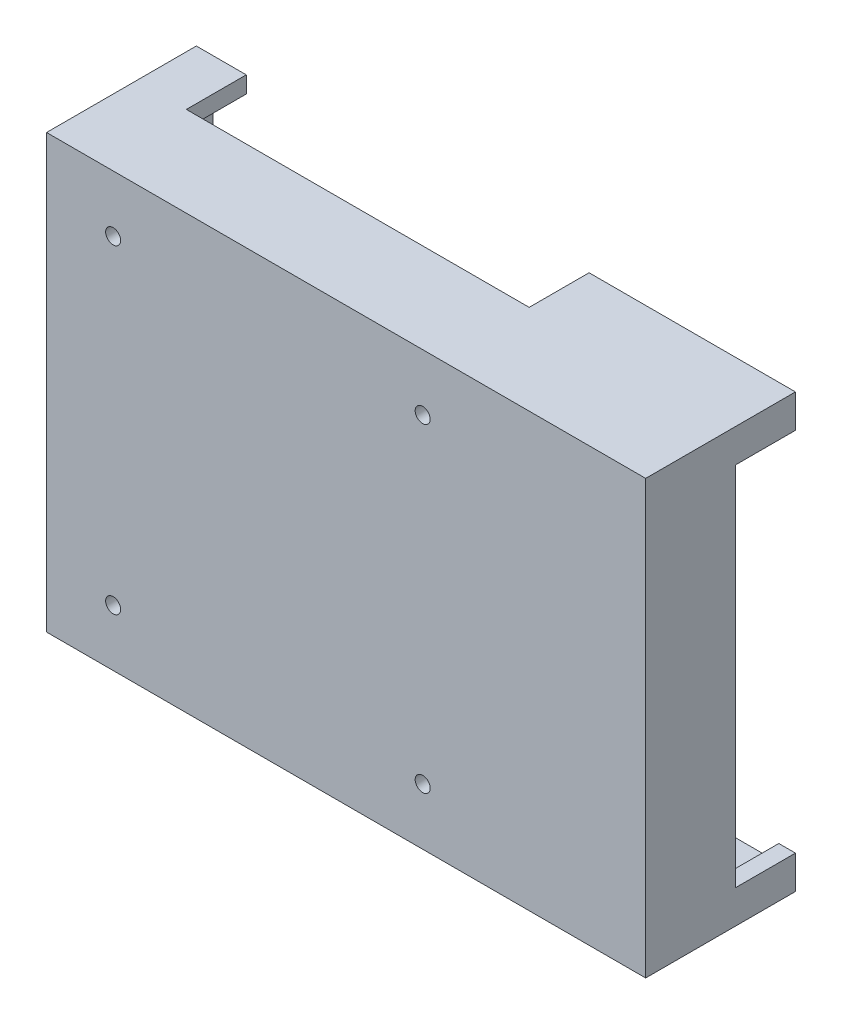
ISO-10303-21;
HEADER;
FILE_DESCRIPTION(('STEP AP214'),'2;1');
FILE_NAME('part.step','',(''),(''),'','','');
FILE_SCHEMA(('AUTOMOTIVE_DESIGN { 1 0 10303 214 1 1 1 1 }'));
ENDSEC;
DATA;
#1=APPLICATION_CONTEXT('core data for automotive mechanical design processes');
#2=APPLICATION_PROTOCOL_DEFINITION('international standard','automotive_design',2000,#1);
#3=PRODUCT_CONTEXT('',#1,'mechanical');
#4=PRODUCT('Part','Part','',(#3));
#5=PRODUCT_RELATED_PRODUCT_CATEGORY('part','',(#4));
#6=PRODUCT_DEFINITION_FORMATION('','',#4);
#7=PRODUCT_DEFINITION_CONTEXT('part definition',#1,'design');
#8=PRODUCT_DEFINITION('design','',#6,#7);
#9=PRODUCT_DEFINITION_SHAPE('','',#8);
#10=(LENGTH_UNIT() NAMED_UNIT(*) SI_UNIT(.MILLI.,.METRE.));
#11=(NAMED_UNIT(*) PLANE_ANGLE_UNIT() SI_UNIT($,.RADIAN.));
#12=(NAMED_UNIT(*) SI_UNIT($,.STERADIAN.) SOLID_ANGLE_UNIT());
#13=UNCERTAINTY_MEASURE_WITH_UNIT(LENGTH_MEASURE(1.E-05),#10,'distance_accuracy_value','');
#14=(GEOMETRIC_REPRESENTATION_CONTEXT(3) GLOBAL_UNCERTAINTY_ASSIGNED_CONTEXT((#13)) GLOBAL_UNIT_ASSIGNED_CONTEXT((#10,
#11,#12)) REPRESENTATION_CONTEXT('',''));
#15=CARTESIAN_POINT('',(0.,0.,0.));
#16=DIRECTION('',(0.,0.,1.));
#17=DIRECTION('',(1.,0.,0.));
#18=AXIS2_PLACEMENT_3D('',#15,#16,#17);
#19=CARTESIAN_POINT('',(0.,0.,0.));
#20=DIRECTION('',(0.,0.,1.));
#21=DIRECTION('',(1.,0.,0.));
#22=AXIS2_PLACEMENT_3D('',#19,#20,#21);
#23=PLANE('',#22);
#24=DIRECTION('',(-1.,0.,0.));
#25=VECTOR('',#24,1.);
#26=CARTESIAN_POINT('',(90.,65.,0.));
#27=LINE('',#26,#25);
#28=CARTESIAN_POINT('',(-75.,65.,0.));
#29=VERTEX_POINT('',#28);
#30=CARTESIAN_POINT('',(-90.,65.,0.));
#31=VERTEX_POINT('',#30);
#32=EDGE_CURVE('E211',#29,#31,#27,.T.);
#33=ORIENTED_EDGE('',*,*,#32,.F.);
#34=DIRECTION('',(0.,-1.,0.));
#35=VECTOR('',#34,1.);
#36=CARTESIAN_POINT('',(-75.,169.560986988456,0.));
#37=LINE('',#36,#35);
#38=CARTESIAN_POINT('',(-75.,60.,0.));
#39=VERTEX_POINT('',#38);
#40=EDGE_CURVE('E194',#29,#39,#37,.T.);
#41=ORIENTED_EDGE('',*,*,#40,.T.);
#42=DIRECTION('',(-1.,0.,0.));
#43=VECTOR('',#42,1.);
#44=CARTESIAN_POINT('',(-85.,60.,0.));
#45=LINE('',#44,#43);
#46=CARTESIAN_POINT('',(-85.,60.,0.));
#47=VERTEX_POINT('',#46);
#48=EDGE_CURVE('E323',#39,#47,#45,.T.);
#49=ORIENTED_EDGE('',*,*,#48,.T.);
#50=DIRECTION('',(0.,-1.,0.));
#51=VECTOR('',#50,1.);
#52=CARTESIAN_POINT('',(-85.,-60.,0.));
#53=LINE('',#52,#51);
#54=CARTESIAN_POINT('',(-85.,-60.,0.));
#55=VERTEX_POINT('',#54);
#56=EDGE_CURVE('E327',#47,#55,#53,.T.);
#57=ORIENTED_EDGE('',*,*,#56,.T.);
#58=DIRECTION('',(1.,0.,0.));
#59=VECTOR('',#58,1.);
#60=CARTESIAN_POINT('',(-85.,-60.,0.));
#61=LINE('',#60,#59);
#62=CARTESIAN_POINT('',(-75.,-60.,0.));
#63=VERTEX_POINT('',#62);
#64=EDGE_CURVE('E193',#55,#63,#61,.T.);
#65=ORIENTED_EDGE('',*,*,#64,.T.);
#66=CARTESIAN_POINT('',(-75.,-65.,0.));
#67=VERTEX_POINT('',#66);
#68=EDGE_CURVE('E175',#63,#67,#37,.T.);
#69=ORIENTED_EDGE('',*,*,#68,.T.);
#70=DIRECTION('',(1.,0.,0.));
#71=VECTOR('',#70,1.);
#72=CARTESIAN_POINT('',(90.,-65.,0.));
#73=LINE('',#72,#71);
#74=CARTESIAN_POINT('',(-90.,-65.,0.));
#75=VERTEX_POINT('',#74);
#76=EDGE_CURVE('E189',#75,#67,#73,.T.);
#77=ORIENTED_EDGE('',*,*,#76,.F.);
#78=DIRECTION('',(0.,-1.,0.));
#79=VECTOR('',#78,1.);
#80=CARTESIAN_POINT('',(-90.,-65.,0.));
#81=LINE('',#80,#79);
#82=EDGE_CURVE('E206',#31,#75,#81,.T.);
#83=ORIENTED_EDGE('',*,*,#82,.F.);
#84=EDGE_LOOP('',(#33,#41,#49,#57,#65,#69,#77,#83));
#85=FACE_BOUND('',#84,.T.);
#86=ADVANCED_FACE('F37',(#85),#23,.F.);
#87=CARTESIAN_POINT('',(28.,-65.,0.));
#88=VERTEX_POINT('',#87);
#89=CARTESIAN_POINT('',(90.,-65.,0.));
#90=VERTEX_POINT('',#89);
#91=EDGE_CURVE('E202',#88,#90,#73,.T.);
#92=ORIENTED_EDGE('',*,*,#91,.F.);
#93=DIRECTION('',(0.,-1.,0.));
#94=VECTOR('',#93,1.);
#95=CARTESIAN_POINT('',(28.,169.560986988456,0.));
#96=LINE('',#95,#94);
#97=CARTESIAN_POINT('',(28.,-60.,0.));
#98=VERTEX_POINT('',#97);
#99=EDGE_CURVE('E239',#98,#88,#96,.T.);
#100=ORIENTED_EDGE('',*,*,#99,.F.);
#101=CARTESIAN_POINT('',(85.,-60.,0.));
#102=VERTEX_POINT('',#101);
#103=EDGE_CURVE('E236',#98,#102,#61,.T.);
#104=ORIENTED_EDGE('',*,*,#103,.T.);
#105=DIRECTION('',(0.,1.,0.));
#106=VECTOR('',#105,1.);
#107=CARTESIAN_POINT('',(85.,-60.,0.));
#108=LINE('',#107,#106);
#109=CARTESIAN_POINT('',(85.,-55.,0.));
#110=VERTEX_POINT('',#109);
#111=EDGE_CURVE('E321',#102,#110,#108,.T.);
#112=ORIENTED_EDGE('',*,*,#111,.T.);
#113=DIRECTION('',(1.,0.,0.));
#114=VECTOR('',#113,1.);
#115=CARTESIAN_POINT('',(-90.001,-55.,0.));
#116=LINE('',#115,#114);
#117=CARTESIAN_POINT('',(90.,-55.,0.));
#118=VERTEX_POINT('',#117);
#119=EDGE_CURVE('E278',#110,#118,#116,.T.);
#120=ORIENTED_EDGE('',*,*,#119,.T.);
#121=DIRECTION('',(0.,1.,0.));
#122=VECTOR('',#121,1.);
#123=CARTESIAN_POINT('',(90.,-65.,0.));
#124=LINE('',#123,#122);
#125=EDGE_CURVE('E204',#90,#118,#124,.T.);
#126=ORIENTED_EDGE('',*,*,#125,.F.);
#127=EDGE_LOOP('',(#92,#100,#104,#112,#120,#126));
#128=FACE_BOUND('',#127,.T.);
#129=ADVANCED_FACE('F243',(#128),#23,.F.);
#130=CARTESIAN_POINT('',(85.,60.,0.));
#131=VERTEX_POINT('',#130);
#132=CARTESIAN_POINT('',(28.,60.,0.));
#133=VERTEX_POINT('',#132);
#134=EDGE_CURVE('E324',#131,#133,#45,.T.);
#135=ORIENTED_EDGE('',*,*,#134,.T.);
#136=CARTESIAN_POINT('',(28.,65.,0.));
#137=VERTEX_POINT('',#136);
#138=EDGE_CURVE('E52',#137,#133,#96,.T.);
#139=ORIENTED_EDGE('',*,*,#138,.F.);
#140=CARTESIAN_POINT('',(90.,65.,0.));
#141=VERTEX_POINT('',#140);
#142=EDGE_CURVE('E212',#141,#137,#27,.T.);
#143=ORIENTED_EDGE('',*,*,#142,.F.);
#144=CARTESIAN_POINT('',(90.,55.,0.));
#145=VERTEX_POINT('',#144);
#146=EDGE_CURVE('E201',#145,#141,#124,.T.);
#147=ORIENTED_EDGE('',*,*,#146,.F.);
#148=DIRECTION('',(1.,0.,0.));
#149=VECTOR('',#148,1.);
#150=CARTESIAN_POINT('',(-90.001,55.,0.));
#151=LINE('',#150,#149);
#152=CARTESIAN_POINT('',(85.,55.,0.));
#153=VERTEX_POINT('',#152);
#154=EDGE_CURVE('E260',#153,#145,#151,.T.);
#155=ORIENTED_EDGE('',*,*,#154,.F.);
#156=EDGE_CURVE('E310',#153,#131,#108,.T.);
#157=ORIENTED_EDGE('',*,*,#156,.T.);
#158=EDGE_LOOP('',(#135,#139,#143,#147,#155,#157));
#159=FACE_BOUND('',#158,.T.);
#160=ADVANCED_FACE('F379',(#159),#23,.F.);
#161=CARTESIAN_POINT('',(-90.,-65.,45.));
#162=DIRECTION('',(1.,0.,0.));
#163=DIRECTION('',(0.,0.,-1.));
#164=AXIS2_PLACEMENT_3D('',#161,#162,#163);
#165=PLANE('',#164);
#166=ORIENTED_EDGE('',*,*,#82,.T.);
#167=DIRECTION('',(0.,0.,-1.));
#168=VECTOR('',#167,1.);
#169=CARTESIAN_POINT('',(-90.,-65.,45.));
#170=LINE('',#169,#168);
#171=CARTESIAN_POINT('',(-90.,-65.,45.));
#172=VERTEX_POINT('',#171);
#173=EDGE_CURVE('E199',#172,#75,#170,.T.);
#174=ORIENTED_EDGE('',*,*,#173,.F.);
#175=DIRECTION('',(0.,-1.,0.));
#176=VECTOR('',#175,1.);
#177=CARTESIAN_POINT('',(-90.,-65.,45.));
#178=LINE('',#177,#176);
#179=CARTESIAN_POINT('',(-90.,65.,45.));
#180=VERTEX_POINT('',#179);
#181=EDGE_CURVE('E215',#180,#172,#178,.T.);
#182=ORIENTED_EDGE('',*,*,#181,.F.);
#183=DIRECTION('',(0.,0.,-1.));
#184=VECTOR('',#183,1.);
#185=CARTESIAN_POINT('',(-90.,65.,45.));
#186=LINE('',#185,#184);
#187=EDGE_CURVE('E216',#180,#31,#186,.T.);
#188=ORIENTED_EDGE('',*,*,#187,.T.);
#189=EDGE_LOOP('',(#166,#174,#182,#188));
#190=FACE_BOUND('',#189,.T.);
#191=ADVANCED_FACE('F39',(#190),#165,.F.);
#192=CARTESIAN_POINT('',(90.,-65.,45.));
#193=DIRECTION('',(0.,1.,0.));
#194=DIRECTION('',(-1.,0.,0.));
#195=AXIS2_PLACEMENT_3D('',#192,#193,#194);
#196=PLANE('',#195);
#197=ORIENTED_EDGE('',*,*,#76,.T.);
#198=DIRECTION('',(0.,0.,-1.));
#199=VECTOR('',#198,1.);
#200=CARTESIAN_POINT('',(-75.,-65.,0.));
#201=LINE('',#200,#199);
#202=CARTESIAN_POINT('',(-75.,-65.,18.));
#203=VERTEX_POINT('',#202);
#204=EDGE_CURVE('E172',#203,#67,#201,.T.);
#205=ORIENTED_EDGE('',*,*,#204,.F.);
#206=DIRECTION('',(-1.,0.,0.));
#207=VECTOR('',#206,1.);
#208=CARTESIAN_POINT('',(-75.,-65.,18.));
#209=LINE('',#208,#207);
#210=CARTESIAN_POINT('',(28.,-65.,18.));
#211=VERTEX_POINT('',#210);
#212=EDGE_CURVE('E195',#211,#203,#209,.T.);
#213=ORIENTED_EDGE('',*,*,#212,.F.);
#214=DIRECTION('',(0.,0.,1.));
#215=VECTOR('',#214,1.);
#216=CARTESIAN_POINT('',(28.,-65.,0.));
#217=LINE('',#216,#215);
#218=EDGE_CURVE('E183',#88,#211,#217,.T.);
#219=ORIENTED_EDGE('',*,*,#218,.F.);
#220=ORIENTED_EDGE('',*,*,#91,.T.);
#221=DIRECTION('',(0.,0.,-1.));
#222=VECTOR('',#221,1.);
#223=CARTESIAN_POINT('',(90.,-65.,45.));
#224=LINE('',#223,#222);
#225=CARTESIAN_POINT('',(90.,-65.,45.));
#226=VERTEX_POINT('',#225);
#227=EDGE_CURVE('E223',#226,#90,#224,.T.);
#228=ORIENTED_EDGE('',*,*,#227,.F.);
#229=DIRECTION('',(1.,0.,0.));
#230=VECTOR('',#229,1.);
#231=CARTESIAN_POINT('',(90.,-65.,45.));
#232=LINE('',#231,#230);
#233=EDGE_CURVE('E341',#172,#226,#232,.T.);
#234=ORIENTED_EDGE('',*,*,#233,.F.);
#235=ORIENTED_EDGE('',*,*,#173,.T.);
#236=EDGE_LOOP('',(#197,#205,#213,#219,#220,#228,#234,#235));
#237=FACE_BOUND('',#236,.T.);
#238=ADVANCED_FACE('F197',(#237),#196,.F.);
#239=CARTESIAN_POINT('',(90.,-65.,45.));
#240=DIRECTION('',(-1.,0.,0.));
#241=DIRECTION('',(0.,-1.,0.));
#242=AXIS2_PLACEMENT_3D('',#239,#240,#241);
#243=PLANE('',#242);
#244=ORIENTED_EDGE('',*,*,#125,.T.);
#245=DIRECTION('',(0.,0.,-1.));
#246=VECTOR('',#245,1.);
#247=CARTESIAN_POINT('',(90.,-55.,0.));
#248=LINE('',#247,#246);
#249=CARTESIAN_POINT('',(90.,-55.,18.));
#250=VERTEX_POINT('',#249);
#251=EDGE_CURVE('E266',#250,#118,#248,.T.);
#252=ORIENTED_EDGE('',*,*,#251,.F.);
#253=DIRECTION('',(0.,-1.,0.));
#254=VECTOR('',#253,1.);
#255=CARTESIAN_POINT('',(90.,55.,18.));
#256=LINE('',#255,#254);
#257=CARTESIAN_POINT('',(90.,55.,18.));
#258=VERTEX_POINT('',#257);
#259=EDGE_CURVE('E269',#258,#250,#256,.T.);
#260=ORIENTED_EDGE('',*,*,#259,.F.);
#261=DIRECTION('',(0.,0.,1.));
#262=VECTOR('',#261,1.);
#263=CARTESIAN_POINT('',(90.,55.,0.));
#264=LINE('',#263,#262);
#265=EDGE_CURVE('E272',#145,#258,#264,.T.);
#266=ORIENTED_EDGE('',*,*,#265,.F.);
#267=ORIENTED_EDGE('',*,*,#146,.T.);
#268=DIRECTION('',(0.,0.,-1.));
#269=VECTOR('',#268,1.);
#270=CARTESIAN_POINT('',(90.,65.,45.));
#271=LINE('',#270,#269);
#272=CARTESIAN_POINT('',(90.,65.,45.));
#273=VERTEX_POINT('',#272);
#274=EDGE_CURVE('E219',#273,#141,#271,.T.);
#275=ORIENTED_EDGE('',*,*,#274,.F.);
#276=DIRECTION('',(0.,1.,0.));
#277=VECTOR('',#276,1.);
#278=CARTESIAN_POINT('',(90.,-65.,45.));
#279=LINE('',#278,#277);
#280=EDGE_CURVE('E343',#226,#273,#279,.T.);
#281=ORIENTED_EDGE('',*,*,#280,.F.);
#282=ORIENTED_EDGE('',*,*,#227,.T.);
#283=EDGE_LOOP('',(#244,#252,#260,#266,#267,#275,#281,#282));
#284=FACE_BOUND('',#283,.T.);
#285=ADVANCED_FACE('F395',(#284),#243,.F.);
#286=CARTESIAN_POINT('',(90.,65.,45.));
#287=DIRECTION('',(0.,-1.,0.));
#288=DIRECTION('',(1.,0.,0.));
#289=AXIS2_PLACEMENT_3D('',#286,#287,#288);
#290=PLANE('',#289);
#291=DIRECTION('',(1.,0.,0.));
#292=VECTOR('',#291,1.);
#293=CARTESIAN_POINT('',(-75.,65.,18.));
#294=LINE('',#293,#292);
#295=CARTESIAN_POINT('',(-75.,65.,18.));
#296=VERTEX_POINT('',#295);
#297=CARTESIAN_POINT('',(28.,65.,18.));
#298=VERTEX_POINT('',#297);
#299=EDGE_CURVE('E404',#296,#298,#294,.T.);
#300=ORIENTED_EDGE('',*,*,#299,.F.);
#301=DIRECTION('',(0.,0.,1.));
#302=VECTOR('',#301,1.);
#303=CARTESIAN_POINT('',(-75.,65.,0.));
#304=LINE('',#303,#302);
#305=EDGE_CURVE('E256',#29,#296,#304,.T.);
#306=ORIENTED_EDGE('',*,*,#305,.F.);
#307=ORIENTED_EDGE('',*,*,#32,.T.);
#308=ORIENTED_EDGE('',*,*,#187,.F.);
#309=DIRECTION('',(-1.,0.,0.));
#310=VECTOR('',#309,1.);
#311=CARTESIAN_POINT('',(90.,65.,45.));
#312=LINE('',#311,#310);
#313=EDGE_CURVE('E220',#273,#180,#312,.T.);
#314=ORIENTED_EDGE('',*,*,#313,.F.);
#315=ORIENTED_EDGE('',*,*,#274,.T.);
#316=ORIENTED_EDGE('',*,*,#142,.T.);
#317=DIRECTION('',(0.,0.,-1.));
#318=VECTOR('',#317,1.);
#319=CARTESIAN_POINT('',(28.,65.,0.));
#320=LINE('',#319,#318);
#321=EDGE_CURVE('E402',#298,#137,#320,.T.);
#322=ORIENTED_EDGE('',*,*,#321,.F.);
#323=EDGE_LOOP('',(#300,#306,#307,#308,#314,#315,#316,#322));
#324=FACE_BOUND('',#323,.T.);
#325=ADVANCED_FACE('F353',(#324),#290,.F.);
#326=CARTESIAN_POINT('',(0.,0.,45.));
#327=DIRECTION('',(0.,0.,1.));
#328=DIRECTION('',(1.,0.,0.));
#329=AXIS2_PLACEMENT_3D('',#326,#327,#328);
#330=PLANE('',#329);
#331=CARTESIAN_POINT('',(23.,-48.,45.));
#332=DIRECTION('',(0.,0.,-1.));
#333=DIRECTION('',(-1.,0.,0.));
#334=AXIS2_PLACEMENT_3D('',#331,#332,#333);
#335=CIRCLE('',#334,2.25);
#336=CARTESIAN_POINT('',(20.75,-48.,45.));
#337=VERTEX_POINT('',#336);
#338=EDGE_CURVE('E289',#337,#337,#335,.T.);
#339=ORIENTED_EDGE('',*,*,#338,.T.);
#340=EDGE_LOOP('',(#339));
#341=FACE_BOUND('',#340,.T.);
#342=CARTESIAN_POINT('',(-70.,-48.,45.));
#343=DIRECTION('',(0.,0.,-1.));
#344=DIRECTION('',(-1.,0.,0.));
#345=AXIS2_PLACEMENT_3D('',#342,#343,#344);
#346=CIRCLE('',#345,2.25);
#347=CARTESIAN_POINT('',(-72.25,-48.,45.));
#348=VERTEX_POINT('',#347);
#349=EDGE_CURVE('E295',#348,#348,#346,.T.);
#350=ORIENTED_EDGE('',*,*,#349,.T.);
#351=EDGE_LOOP('',(#350));
#352=FACE_BOUND('',#351,.T.);
#353=CARTESIAN_POINT('',(-70.,48.,45.));
#354=DIRECTION('',(0.,0.,-1.));
#355=DIRECTION('',(-1.,0.,0.));
#356=AXIS2_PLACEMENT_3D('',#353,#354,#355);
#357=CIRCLE('',#356,2.25);
#358=CARTESIAN_POINT('',(-72.25,48.,45.));
#359=VERTEX_POINT('',#358);
#360=EDGE_CURVE('E301',#359,#359,#357,.T.);
#361=ORIENTED_EDGE('',*,*,#360,.T.);
#362=EDGE_LOOP('',(#361));
#363=FACE_BOUND('',#362,.T.);
#364=CARTESIAN_POINT('',(23.,48.,45.));
#365=DIRECTION('',(0.,0.,-1.));
#366=DIRECTION('',(-1.,0.,0.));
#367=AXIS2_PLACEMENT_3D('',#364,#365,#366);
#368=CIRCLE('',#367,2.25);
#369=CARTESIAN_POINT('',(20.75,48.,45.));
#370=VERTEX_POINT('',#369);
#371=EDGE_CURVE('E307',#370,#370,#368,.T.);
#372=ORIENTED_EDGE('',*,*,#371,.T.);
#373=EDGE_LOOP('',(#372));
#374=FACE_BOUND('',#373,.T.);
#375=ORIENTED_EDGE('',*,*,#181,.T.);
#376=ORIENTED_EDGE('',*,*,#233,.T.);
#377=ORIENTED_EDGE('',*,*,#280,.T.);
#378=ORIENTED_EDGE('',*,*,#313,.T.);
#379=EDGE_LOOP('',(#375,#376,#377,#378));
#380=FACE_BOUND('',#379,.T.);
#381=ADVANCED_FACE('F347',(#341,#352,#363,#374,#380),#330,.T.);
#382=CARTESIAN_POINT('',(85.,-60.,40.));
#383=DIRECTION('',(-1.,0.,0.));
#384=DIRECTION('',(0.,0.,1.));
#385=AXIS2_PLACEMENT_3D('',#382,#383,#384);
#386=PLANE('',#385);
#387=DIRECTION('',(0.,0.,-1.));
#388=VECTOR('',#387,1.);
#389=CARTESIAN_POINT('',(85.,-55.,0.));
#390=LINE('',#389,#388);
#391=CARTESIAN_POINT('',(85.,-55.,18.));
#392=VERTEX_POINT('',#391);
#393=EDGE_CURVE('E275',#392,#110,#390,.T.);
#394=ORIENTED_EDGE('',*,*,#393,.T.);
#395=ORIENTED_EDGE('',*,*,#111,.F.);
#396=DIRECTION('',(0.,0.,-1.));
#397=VECTOR('',#396,1.);
#398=CARTESIAN_POINT('',(85.,-60.,40.));
#399=LINE('',#398,#397);
#400=CARTESIAN_POINT('',(85.,-60.,40.));
#401=VERTEX_POINT('',#400);
#402=EDGE_CURVE('E320',#401,#102,#399,.T.);
#403=ORIENTED_EDGE('',*,*,#402,.F.);
#404=DIRECTION('',(0.,1.,0.));
#405=VECTOR('',#404,1.);
#406=CARTESIAN_POINT('',(85.,-60.,40.));
#407=LINE('',#406,#405);
#408=CARTESIAN_POINT('',(85.,60.,40.));
#409=VERTEX_POINT('',#408);
#410=EDGE_CURVE('E311',#401,#409,#407,.T.);
#411=ORIENTED_EDGE('',*,*,#410,.T.);
#412=DIRECTION('',(0.,0.,-1.));
#413=VECTOR('',#412,1.);
#414=CARTESIAN_POINT('',(85.,60.,40.));
#415=LINE('',#414,#413);
#416=EDGE_CURVE('E336',#409,#131,#415,.T.);
#417=ORIENTED_EDGE('',*,*,#416,.T.);
#418=ORIENTED_EDGE('',*,*,#156,.F.);
#419=DIRECTION('',(0.,0.,1.));
#420=VECTOR('',#419,1.);
#421=CARTESIAN_POINT('',(85.,55.,0.));
#422=LINE('',#421,#420);
#423=CARTESIAN_POINT('',(85.,55.,18.));
#424=VERTEX_POINT('',#423);
#425=EDGE_CURVE('E261',#153,#424,#422,.T.);
#426=ORIENTED_EDGE('',*,*,#425,.T.);
#427=DIRECTION('',(0.,-1.,0.));
#428=VECTOR('',#427,1.);
#429=CARTESIAN_POINT('',(85.,55.,18.));
#430=LINE('',#429,#428);
#431=EDGE_CURVE('E279',#424,#392,#430,.T.);
#432=ORIENTED_EDGE('',*,*,#431,.T.);
#433=EDGE_LOOP('',(#394,#395,#403,#411,#417,#418,#426,#432));
#434=FACE_BOUND('',#433,.T.);
#435=ADVANCED_FACE('F375',(#434),#386,.T.);
#436=CARTESIAN_POINT('',(-85.,60.,40.));
#437=DIRECTION('',(0.,-1.,0.));
#438=DIRECTION('',(0.,0.,-1.));
#439=AXIS2_PLACEMENT_3D('',#436,#437,#438);
#440=PLANE('',#439);
#441=DIRECTION('',(0.,0.,-1.));
#442=VECTOR('',#441,1.);
#443=CARTESIAN_POINT('',(-75.,60.,40.));
#444=LINE('',#443,#442);
#445=CARTESIAN_POINT('',(-75.,60.,18.));
#446=VERTEX_POINT('',#445);
#447=EDGE_CURVE('E258',#446,#39,#444,.T.);
#448=ORIENTED_EDGE('',*,*,#447,.F.);
#449=DIRECTION('',(-1.,0.,0.));
#450=VECTOR('',#449,1.);
#451=CARTESIAN_POINT('',(-85.,60.,18.));
#452=LINE('',#451,#450);
#453=CARTESIAN_POINT('',(28.,60.,18.));
#454=VERTEX_POINT('',#453);
#455=EDGE_CURVE('E255',#454,#446,#452,.T.);
#456=ORIENTED_EDGE('',*,*,#455,.F.);
#457=DIRECTION('',(0.,0.,1.));
#458=VECTOR('',#457,1.);
#459=CARTESIAN_POINT('',(28.,60.,40.));
#460=LINE('',#459,#458);
#461=EDGE_CURVE('E253',#133,#454,#460,.T.);
#462=ORIENTED_EDGE('',*,*,#461,.F.);
#463=ORIENTED_EDGE('',*,*,#134,.F.);
#464=ORIENTED_EDGE('',*,*,#416,.F.);
#465=DIRECTION('',(-1.,0.,0.));
#466=VECTOR('',#465,1.);
#467=CARTESIAN_POINT('',(-85.,60.,40.));
#468=LINE('',#467,#466);
#469=CARTESIAN_POINT('',(-85.,60.,40.));
#470=VERTEX_POINT('',#469);
#471=EDGE_CURVE('E314',#409,#470,#468,.T.);
#472=ORIENTED_EDGE('',*,*,#471,.T.);
#473=DIRECTION('',(0.,0.,-1.));
#474=VECTOR('',#473,1.);
#475=CARTESIAN_POINT('',(-85.,60.,40.));
#476=LINE('',#475,#474);
#477=EDGE_CURVE('E333',#470,#47,#476,.T.);
#478=ORIENTED_EDGE('',*,*,#477,.T.);
#479=ORIENTED_EDGE('',*,*,#48,.F.);
#480=EDGE_LOOP('',(#448,#456,#462,#463,#464,#472,#478,#479));
#481=FACE_BOUND('',#480,.T.);
#482=ADVANCED_FACE('F360',(#481),#440,.T.);
#483=CARTESIAN_POINT('',(-85.,-60.,40.));
#484=DIRECTION('',(1.,0.,0.));
#485=DIRECTION('',(0.,0.,-1.));
#486=AXIS2_PLACEMENT_3D('',#483,#484,#485);
#487=PLANE('',#486);
#488=ORIENTED_EDGE('',*,*,#56,.F.);
#489=ORIENTED_EDGE('',*,*,#477,.F.);
#490=DIRECTION('',(0.,-1.,0.));
#491=VECTOR('',#490,1.);
#492=CARTESIAN_POINT('',(-85.,-60.,40.));
#493=LINE('',#492,#491);
#494=CARTESIAN_POINT('',(-85.,-60.,40.));
#495=VERTEX_POINT('',#494);
#496=EDGE_CURVE('E316',#470,#495,#493,.T.);
#497=ORIENTED_EDGE('',*,*,#496,.T.);
#498=DIRECTION('',(0.,0.,-1.));
#499=VECTOR('',#498,1.);
#500=CARTESIAN_POINT('',(-85.,-60.,40.));
#501=LINE('',#500,#499);
#502=EDGE_CURVE('E331',#495,#55,#501,.T.);
#503=ORIENTED_EDGE('',*,*,#502,.T.);
#504=EDGE_LOOP('',(#488,#489,#497,#503));
#505=FACE_BOUND('',#504,.T.);
#506=ADVANCED_FACE('F367',(#505),#487,.T.);
#507=CARTESIAN_POINT('',(-85.,-60.,40.));
#508=DIRECTION('',(0.,1.,0.));
#509=DIRECTION('',(0.,0.,1.));
#510=AXIS2_PLACEMENT_3D('',#507,#508,#509);
#511=PLANE('',#510);
#512=DIRECTION('',(0.,0.,1.));
#513=VECTOR('',#512,1.);
#514=CARTESIAN_POINT('',(-75.,-60.,40.));
#515=LINE('',#514,#513);
#516=CARTESIAN_POINT('',(-75.,-60.,18.));
#517=VERTEX_POINT('',#516);
#518=EDGE_CURVE('E11',#63,#517,#515,.T.);
#519=ORIENTED_EDGE('',*,*,#518,.F.);
#520=ORIENTED_EDGE('',*,*,#64,.F.);
#521=ORIENTED_EDGE('',*,*,#502,.F.);
#522=DIRECTION('',(1.,0.,0.));
#523=VECTOR('',#522,1.);
#524=CARTESIAN_POINT('',(-85.,-60.,40.));
#525=LINE('',#524,#523);
#526=EDGE_CURVE('E318',#495,#401,#525,.T.);
#527=ORIENTED_EDGE('',*,*,#526,.T.);
#528=ORIENTED_EDGE('',*,*,#402,.T.);
#529=ORIENTED_EDGE('',*,*,#103,.F.);
#530=DIRECTION('',(0.,0.,-1.));
#531=VECTOR('',#530,1.);
#532=CARTESIAN_POINT('',(28.,-60.,40.));
#533=LINE('',#532,#531);
#534=CARTESIAN_POINT('',(28.,-60.,18.));
#535=VERTEX_POINT('',#534);
#536=EDGE_CURVE('E227',#535,#98,#533,.T.);
#537=ORIENTED_EDGE('',*,*,#536,.F.);
#538=DIRECTION('',(1.,0.,0.));
#539=VECTOR('',#538,1.);
#540=CARTESIAN_POINT('',(-85.,-60.,18.));
#541=LINE('',#540,#539);
#542=EDGE_CURVE('E45',#517,#535,#541,.T.);
#543=ORIENTED_EDGE('',*,*,#542,.F.);
#544=EDGE_LOOP('',(#519,#520,#521,#527,#528,#529,#537,#543));
#545=FACE_BOUND('',#544,.T.);
#546=ADVANCED_FACE('F234',(#545),#511,.T.);
#547=CARTESIAN_POINT('',(0.,0.,40.));
#548=DIRECTION('',(0.,0.,-1.));
#549=DIRECTION('',(-1.,0.,0.));
#550=AXIS2_PLACEMENT_3D('',#547,#548,#549);
#551=PLANE('',#550);
#552=CARTESIAN_POINT('',(23.,-48.,40.));
#553=DIRECTION('',(0.,0.,-1.));
#554=DIRECTION('',(-1.,0.,0.));
#555=AXIS2_PLACEMENT_3D('',#552,#553,#554);
#556=CIRCLE('',#555,2.24999999999999);
#557=CARTESIAN_POINT('',(20.75,-48.,40.));
#558=VERTEX_POINT('',#557);
#559=EDGE_CURVE('E268',#558,#558,#556,.T.);
#560=ORIENTED_EDGE('',*,*,#559,.F.);
#561=EDGE_LOOP('',(#560));
#562=FACE_BOUND('',#561,.T.);
#563=CARTESIAN_POINT('',(-70.,-48.,40.));
#564=DIRECTION('',(0.,0.,-1.));
#565=DIRECTION('',(-1.,0.,0.));
#566=AXIS2_PLACEMENT_3D('',#563,#564,#565);
#567=CIRCLE('',#566,2.24999999999999);
#568=CARTESIAN_POINT('',(-72.25,-48.,40.));
#569=VERTEX_POINT('',#568);
#570=EDGE_CURVE('E292',#569,#569,#567,.T.);
#571=ORIENTED_EDGE('',*,*,#570,.F.);
#572=EDGE_LOOP('',(#571));
#573=FACE_BOUND('',#572,.T.);
#574=CARTESIAN_POINT('',(-70.,48.,40.));
#575=DIRECTION('',(0.,0.,-1.));
#576=DIRECTION('',(-1.,0.,0.));
#577=AXIS2_PLACEMENT_3D('',#574,#575,#576);
#578=CIRCLE('',#577,2.24999999999999);
#579=CARTESIAN_POINT('',(-72.25,48.,40.));
#580=VERTEX_POINT('',#579);
#581=EDGE_CURVE('E298',#580,#580,#578,.T.);
#582=ORIENTED_EDGE('',*,*,#581,.F.);
#583=EDGE_LOOP('',(#582));
#584=FACE_BOUND('',#583,.T.);
#585=CARTESIAN_POINT('',(23.,48.,40.));
#586=DIRECTION('',(0.,0.,-1.));
#587=DIRECTION('',(-1.,0.,0.));
#588=AXIS2_PLACEMENT_3D('',#585,#586,#587);
#589=CIRCLE('',#588,2.24999999999999);
#590=CARTESIAN_POINT('',(20.75,48.,40.));
#591=VERTEX_POINT('',#590);
#592=EDGE_CURVE('E304',#591,#591,#589,.T.);
#593=ORIENTED_EDGE('',*,*,#592,.F.);
#594=EDGE_LOOP('',(#593));
#595=FACE_BOUND('',#594,.T.);
#596=ORIENTED_EDGE('',*,*,#410,.F.);
#597=ORIENTED_EDGE('',*,*,#526,.F.);
#598=ORIENTED_EDGE('',*,*,#496,.F.);
#599=ORIENTED_EDGE('',*,*,#471,.F.);
#600=EDGE_LOOP('',(#596,#597,#598,#599));
#601=FACE_BOUND('',#600,.T.);
#602=ADVANCED_FACE('F373',(#562,#573,#584,#595,#601),#551,.T.);
#603=CARTESIAN_POINT('',(23.,48.,40.));
#604=DIRECTION('',(0.,0.,-1.));
#605=DIRECTION('',(-1.,0.,0.));
#606=AXIS2_PLACEMENT_3D('',#603,#604,#605);
#607=CYLINDRICAL_SURFACE('',#606,2.24999999999999);
#608=ORIENTED_EDGE('',*,*,#371,.F.);
#609=EDGE_LOOP('',(#608));
#610=FACE_BOUND('',#609,.T.);
#611=ORIENTED_EDGE('',*,*,#592,.T.);
#612=EDGE_LOOP('',(#611));
#613=FACE_BOUND('',#612,.T.);
#614=ADVANCED_FACE('F460',(#610,#613),#607,.F.);
#615=CARTESIAN_POINT('',(-70.,48.,40.));
#616=DIRECTION('',(0.,0.,-1.));
#617=DIRECTION('',(-1.,0.,0.));
#618=AXIS2_PLACEMENT_3D('',#615,#616,#617);
#619=CYLINDRICAL_SURFACE('',#618,2.25);
#620=ORIENTED_EDGE('',*,*,#360,.F.);
#621=EDGE_LOOP('',(#620));
#622=FACE_BOUND('',#621,.T.);
#623=ORIENTED_EDGE('',*,*,#581,.T.);
#624=EDGE_LOOP('',(#623));
#625=FACE_BOUND('',#624,.T.);
#626=ADVANCED_FACE('F464',(#622,#625),#619,.F.);
#627=CARTESIAN_POINT('',(-70.,-48.,40.));
#628=DIRECTION('',(0.,0.,-1.));
#629=DIRECTION('',(-1.,0.,0.));
#630=AXIS2_PLACEMENT_3D('',#627,#628,#629);
#631=CYLINDRICAL_SURFACE('',#630,2.25);
#632=ORIENTED_EDGE('',*,*,#349,.F.);
#633=EDGE_LOOP('',(#632));
#634=FACE_BOUND('',#633,.T.);
#635=ORIENTED_EDGE('',*,*,#570,.T.);
#636=EDGE_LOOP('',(#635));
#637=FACE_BOUND('',#636,.T.);
#638=ADVANCED_FACE('F468',(#634,#637),#631,.F.);
#639=CARTESIAN_POINT('',(23.,-48.,40.));
#640=DIRECTION('',(0.,0.,-1.));
#641=DIRECTION('',(-1.,0.,0.));
#642=AXIS2_PLACEMENT_3D('',#639,#640,#641);
#643=CYLINDRICAL_SURFACE('',#642,2.24999999999999);
#644=ORIENTED_EDGE('',*,*,#338,.F.);
#645=EDGE_LOOP('',(#644));
#646=FACE_BOUND('',#645,.T.);
#647=ORIENTED_EDGE('',*,*,#559,.T.);
#648=EDGE_LOOP('',(#647));
#649=FACE_BOUND('',#648,.T.);
#650=ADVANCED_FACE('F472',(#646,#649),#643,.F.);
#651=CARTESIAN_POINT('',(-90.001,-55.,0.));
#652=DIRECTION('',(0.,-1.,0.));
#653=DIRECTION('',(1.,0.,0.));
#654=AXIS2_PLACEMENT_3D('',#651,#652,#653);
#655=PLANE('',#654);
#656=DIRECTION('',(1.,0.,0.));
#657=VECTOR('',#656,1.);
#658=CARTESIAN_POINT('',(-90.001,-55.,18.));
#659=LINE('',#658,#657);
#660=EDGE_CURVE('E265',#392,#250,#659,.T.);
#661=ORIENTED_EDGE('',*,*,#660,.T.);
#662=ORIENTED_EDGE('',*,*,#251,.T.);
#663=ORIENTED_EDGE('',*,*,#119,.F.);
#664=ORIENTED_EDGE('',*,*,#393,.F.);
#665=EDGE_LOOP('',(#661,#662,#663,#664));
#666=FACE_BOUND('',#665,.T.);
#667=ADVANCED_FACE('F393',(#666),#655,.F.);
#668=CARTESIAN_POINT('',(-90.001,55.,18.));
#669=DIRECTION('',(0.,0.,1.));
#670=DIRECTION('',(0.,-1.,0.));
#671=AXIS2_PLACEMENT_3D('',#668,#669,#670);
#672=PLANE('',#671);
#673=DIRECTION('',(1.,0.,0.));
#674=VECTOR('',#673,1.);
#675=CARTESIAN_POINT('',(-90.001,55.,18.));
#676=LINE('',#675,#674);
#677=EDGE_CURVE('E264',#424,#258,#676,.T.);
#678=ORIENTED_EDGE('',*,*,#677,.T.);
#679=ORIENTED_EDGE('',*,*,#259,.T.);
#680=ORIENTED_EDGE('',*,*,#660,.F.);
#681=ORIENTED_EDGE('',*,*,#431,.F.);
#682=EDGE_LOOP('',(#678,#679,#680,#681));
#683=FACE_BOUND('',#682,.T.);
#684=ADVANCED_FACE('F390',(#683),#672,.F.);
#685=CARTESIAN_POINT('',(-90.001,55.,0.));
#686=DIRECTION('',(0.,1.,0.));
#687=DIRECTION('',(-1.,0.,0.));
#688=AXIS2_PLACEMENT_3D('',#685,#686,#687);
#689=PLANE('',#688);
#690=ORIENTED_EDGE('',*,*,#154,.T.);
#691=ORIENTED_EDGE('',*,*,#265,.T.);
#692=ORIENTED_EDGE('',*,*,#677,.F.);
#693=ORIENTED_EDGE('',*,*,#425,.F.);
#694=EDGE_LOOP('',(#690,#691,#692,#693));
#695=FACE_BOUND('',#694,.T.);
#696=ADVANCED_FACE('F385',(#695),#689,.F.);
#697=CARTESIAN_POINT('',(28.,169.560986988456,0.));
#698=DIRECTION('',(1.,0.,0.));
#699=DIRECTION('',(0.,1.,0.));
#700=AXIS2_PLACEMENT_3D('',#697,#698,#699);
#701=PLANE('',#700);
#702=ORIENTED_EDGE('',*,*,#536,.T.);
#703=ORIENTED_EDGE('',*,*,#99,.T.);
#704=ORIENTED_EDGE('',*,*,#218,.T.);
#705=DIRECTION('',(0.,-1.,0.));
#706=VECTOR('',#705,1.);
#707=CARTESIAN_POINT('',(28.,169.560986988456,18.));
#708=LINE('',#707,#706);
#709=EDGE_CURVE('E60',#535,#211,#708,.T.);
#710=ORIENTED_EDGE('',*,*,#709,.F.);
#711=EDGE_LOOP('',(#702,#703,#704,#710));
#712=FACE_BOUND('',#711,.T.);
#713=ADVANCED_FACE('F238',(#712),#701,.F.);
#714=CARTESIAN_POINT('',(-75.,169.560986988456,18.));
#715=DIRECTION('',(0.,0.,1.));
#716=DIRECTION('',(1.,0.,0.));
#717=AXIS2_PLACEMENT_3D('',#714,#715,#716);
#718=PLANE('',#717);
#719=ORIENTED_EDGE('',*,*,#542,.T.);
#720=ORIENTED_EDGE('',*,*,#709,.T.);
#721=ORIENTED_EDGE('',*,*,#212,.T.);
#722=DIRECTION('',(0.,-1.,0.));
#723=VECTOR('',#722,1.);
#724=CARTESIAN_POINT('',(-75.,169.560986988456,18.));
#725=LINE('',#724,#723);
#726=EDGE_CURVE('E178',#517,#203,#725,.T.);
#727=ORIENTED_EDGE('',*,*,#726,.F.);
#728=EDGE_LOOP('',(#719,#720,#721,#727));
#729=FACE_BOUND('',#728,.T.);
#730=ADVANCED_FACE('F231',(#729),#718,.F.);
#731=CARTESIAN_POINT('',(-75.,169.560986988456,0.));
#732=DIRECTION('',(-1.,0.,0.));
#733=DIRECTION('',(0.,-1.,0.));
#734=AXIS2_PLACEMENT_3D('',#731,#732,#733);
#735=PLANE('',#734);
#736=ORIENTED_EDGE('',*,*,#518,.T.);
#737=ORIENTED_EDGE('',*,*,#726,.T.);
#738=ORIENTED_EDGE('',*,*,#204,.T.);
#739=ORIENTED_EDGE('',*,*,#68,.F.);
#740=EDGE_LOOP('',(#736,#737,#738,#739));
#741=FACE_BOUND('',#740,.T.);
#742=ADVANCED_FACE('F174',(#741),#735,.F.);
#743=ORIENTED_EDGE('',*,*,#447,.T.);
#744=ORIENTED_EDGE('',*,*,#40,.F.);
#745=ORIENTED_EDGE('',*,*,#305,.T.);
#746=EDGE_CURVE('E400',#296,#446,#725,.T.);
#747=ORIENTED_EDGE('',*,*,#746,.T.);
#748=EDGE_LOOP('',(#743,#744,#745,#747));
#749=FACE_BOUND('',#748,.T.);
#750=ADVANCED_FACE('F413',(#749),#735,.F.);
#751=ORIENTED_EDGE('',*,*,#455,.T.);
#752=ORIENTED_EDGE('',*,*,#746,.F.);
#753=ORIENTED_EDGE('',*,*,#299,.T.);
#754=EDGE_CURVE('E250',#298,#454,#708,.T.);
#755=ORIENTED_EDGE('',*,*,#754,.T.);
#756=EDGE_LOOP('',(#751,#752,#753,#755));
#757=FACE_BOUND('',#756,.T.);
#758=ADVANCED_FACE('F409',(#757),#718,.F.);
#759=ORIENTED_EDGE('',*,*,#461,.T.);
#760=ORIENTED_EDGE('',*,*,#754,.F.);
#761=ORIENTED_EDGE('',*,*,#321,.T.);
#762=ORIENTED_EDGE('',*,*,#138,.T.);
#763=EDGE_LOOP('',(#759,#760,#761,#762));
#764=FACE_BOUND('',#763,.T.);
#765=ADVANCED_FACE('F411',(#764),#701,.F.);
#766=CLOSED_SHELL('',(#86,#129,#160,#191,#238,#285,#325,#381,#435,#482,#506,#546,#602,#614,#626,
#638,#650,#667,#684,#696,#713,#730,#742,#750,#758,#765));
#767=MANIFOLD_SOLID_BREP('B2',#766);
#768=ADVANCED_BREP_SHAPE_REPRESENTATION('',(#18,#767),#14);
#769=SHAPE_DEFINITION_REPRESENTATION(#9,#768);
ENDSEC;
END-ISO-10303-21;
